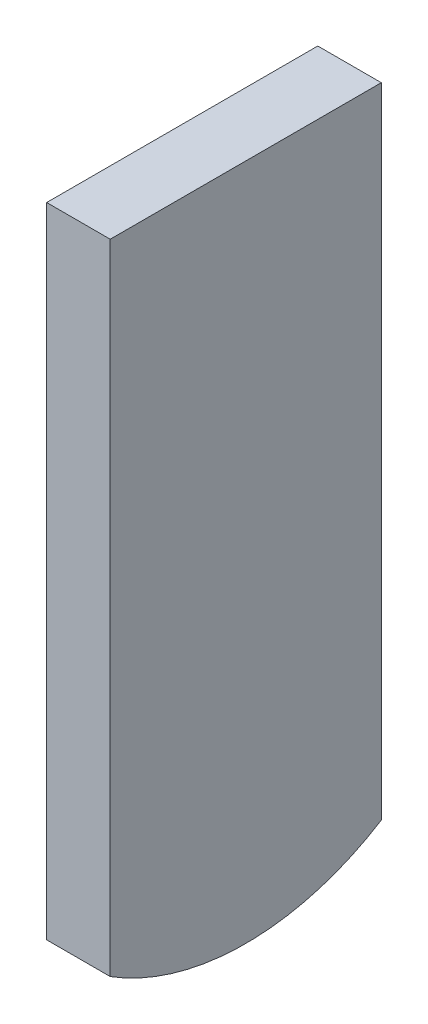
ISO-10303-21;
HEADER;
FILE_DESCRIPTION(('STEP AP214'),'2;1');
FILE_NAME('part.step','',(''),(''),'','','');
FILE_SCHEMA(('AUTOMOTIVE_DESIGN { 1 0 10303 214 1 1 1 1 }'));
ENDSEC;
DATA;
#1=APPLICATION_CONTEXT('core data for automotive mechanical design processes');
#2=APPLICATION_PROTOCOL_DEFINITION('international standard','automotive_design',2000,#1);
#3=PRODUCT_CONTEXT('',#1,'mechanical');
#4=PRODUCT('Part','Part','',(#3));
#5=PRODUCT_RELATED_PRODUCT_CATEGORY('part','',(#4));
#6=PRODUCT_DEFINITION_FORMATION('','',#4);
#7=PRODUCT_DEFINITION_CONTEXT('part definition',#1,'design');
#8=PRODUCT_DEFINITION('design','',#6,#7);
#9=PRODUCT_DEFINITION_SHAPE('','',#8);
#10=(LENGTH_UNIT() NAMED_UNIT(*) SI_UNIT(.MILLI.,.METRE.));
#11=(NAMED_UNIT(*) PLANE_ANGLE_UNIT() SI_UNIT($,.RADIAN.));
#12=(NAMED_UNIT(*) SI_UNIT($,.STERADIAN.) SOLID_ANGLE_UNIT());
#13=UNCERTAINTY_MEASURE_WITH_UNIT(LENGTH_MEASURE(1.E-05),#10,'distance_accuracy_value','');
#14=(GEOMETRIC_REPRESENTATION_CONTEXT(3) GLOBAL_UNCERTAINTY_ASSIGNED_CONTEXT((#13)) GLOBAL_UNIT_ASSIGNED_CONTEXT((#10,
#11,#12)) REPRESENTATION_CONTEXT('',''));
#15=CARTESIAN_POINT('',(0.,0.,0.));
#16=DIRECTION('',(0.,0.,1.));
#17=DIRECTION('',(1.,0.,0.));
#18=AXIS2_PLACEMENT_3D('',#15,#16,#17);
#19=CARTESIAN_POINT('',(22.5596096334287,-9.99999999999998,0.));
#20=DIRECTION('',(-0.999999999999997,0.,0.));
#21=DIRECTION('',(0.,0.,0.999999999999997));
#22=AXIS2_PLACEMENT_3D('',#19,#20,#21);
#23=CYLINDRICAL_SURFACE('',#22,6.);
#24=DIRECTION('',(-0.999999999999997,0.,0.));
#25=VECTOR('',#24,1.);
#26=CARTESIAN_POINT('',(22.5596096334285,-15.0754310161798,-3.19999999999993));
#27=LINE('',#26,#25);
#28=CARTESIAN_POINT('',(0.750000000000141,-15.0754310161798,-3.19999999999997));
#29=VERTEX_POINT('',#28);
#30=CARTESIAN_POINT('',(-0.749999999999917,-15.0754310161798,-3.19999999999987));
#31=VERTEX_POINT('',#30);
#32=EDGE_CURVE('E79',#29,#31,#27,.T.);
#33=ORIENTED_EDGE('',*,*,#32,.F.);
#34=CARTESIAN_POINT('',(0.750000000000001,-10.,0.));
#35=DIRECTION('',(0.999999999999997,0.,0.));
#36=DIRECTION('',(0.,0.,-0.999999999999997));
#37=AXIS2_PLACEMENT_3D('',#34,#35,#36);
#38=CIRCLE('',#37,6.);
#39=CARTESIAN_POINT('',(0.750000000000197,-15.0754310161798,3.20000000000014));
#40=VERTEX_POINT('',#39);
#41=EDGE_CURVE('E51',#29,#40,#38,.F.);
#42=ORIENTED_EDGE('',*,*,#41,.T.);
#43=DIRECTION('',(-0.999999999999997,0.,0.));
#44=VECTOR('',#43,1.);
#45=CARTESIAN_POINT('',(22.5596096334285,-15.0754310161798,3.19999999999998));
#46=LINE('',#45,#44);
#47=CARTESIAN_POINT('',(-0.750000000000028,-15.0754310161798,3.19999999999998));
#48=VERTEX_POINT('',#47);
#49=EDGE_CURVE('E90',#40,#48,#46,.T.);
#50=ORIENTED_EDGE('',*,*,#49,.T.);
#51=CARTESIAN_POINT('',(-0.74999999999964,-10.,0.));
#52=DIRECTION('',(-0.999999999999997,0.,0.));
#53=DIRECTION('',(0.,0.,0.999999999999997));
#54=AXIS2_PLACEMENT_3D('',#51,#52,#53);
#55=CIRCLE('',#54,6.);
#56=EDGE_CURVE('E59',#48,#31,#55,.F.);
#57=ORIENTED_EDGE('',*,*,#56,.T.);
#58=EDGE_LOOP('',(#33,#42,#50,#57));
#59=FACE_BOUND('',#58,.T.);
#60=ADVANCED_FACE('F34',(#59),#23,.T.);
#61=CARTESIAN_POINT('',(0.750000000000197,-15.9999999999999,3.20000000000014));
#62=DIRECTION('',(0.999999999999997,0.,0.));
#63=DIRECTION('',(0.,0.,-0.999999999999997));
#64=AXIS2_PLACEMENT_3D('',#61,#62,#63);
#65=PLANE('',#64);
#66=ORIENTED_EDGE('',*,*,#41,.F.);
#67=DIRECTION('',(0.,1.,0.));
#68=VECTOR('',#67,1.);
#69=CARTESIAN_POINT('',(0.750000000000141,-15.9999999999999,-3.19999999999997));
#70=LINE('',#69,#68);
#71=CARTESIAN_POINT('',(0.750000000000141,0.,-3.19999999999997));
#72=VERTEX_POINT('',#71);
#73=EDGE_CURVE('E38',#29,#72,#70,.T.);
#74=ORIENTED_EDGE('',*,*,#73,.T.);
#75=DIRECTION('',(0.,0.,-0.999999999999997));
#76=VECTOR('',#75,1.);
#77=CARTESIAN_POINT('',(0.750000000000197,0.,3.20000000000014));
#78=LINE('',#77,#76);
#79=CARTESIAN_POINT('',(0.750000000000197,0.,3.20000000000014));
#80=VERTEX_POINT('',#79);
#81=EDGE_CURVE('E88',#80,#72,#78,.T.);
#82=ORIENTED_EDGE('',*,*,#81,.F.);
#83=DIRECTION('',(0.,1.,0.));
#84=VECTOR('',#83,1.);
#85=CARTESIAN_POINT('',(0.750000000000197,-15.9999999999999,3.20000000000014));
#86=LINE('',#85,#84);
#87=EDGE_CURVE('E11',#40,#80,#86,.T.);
#88=ORIENTED_EDGE('',*,*,#87,.F.);
#89=EDGE_LOOP('',(#66,#74,#82,#88));
#90=FACE_BOUND('',#89,.T.);
#91=ADVANCED_FACE('F36',(#90),#65,.T.);
#92=CARTESIAN_POINT('',(-0.750000000000028,-15.9999999999999,3.19999999999998));
#93=DIRECTION('',(0.,0.,0.999999999999997));
#94=DIRECTION('',(0.999999999999997,0.,0.));
#95=AXIS2_PLACEMENT_3D('',#92,#93,#94);
#96=PLANE('',#95);
#97=ORIENTED_EDGE('',*,*,#49,.F.);
#98=ORIENTED_EDGE('',*,*,#87,.T.);
#99=DIRECTION('',(0.999999999999997,0.,0.));
#100=VECTOR('',#99,1.);
#101=CARTESIAN_POINT('',(-0.750000000000028,0.,3.19999999999998));
#102=LINE('',#101,#100);
#103=CARTESIAN_POINT('',(-0.750000000000028,0.,3.19999999999998));
#104=VERTEX_POINT('',#103);
#105=EDGE_CURVE('E86',#104,#80,#102,.T.);
#106=ORIENTED_EDGE('',*,*,#105,.F.);
#107=DIRECTION('',(0.,1.,0.));
#108=VECTOR('',#107,1.);
#109=CARTESIAN_POINT('',(-0.750000000000028,-15.9999999999999,3.19999999999998));
#110=LINE('',#109,#108);
#111=EDGE_CURVE('E43',#48,#104,#110,.T.);
#112=ORIENTED_EDGE('',*,*,#111,.F.);
#113=EDGE_LOOP('',(#97,#98,#106,#112));
#114=FACE_BOUND('',#113,.T.);
#115=ADVANCED_FACE('F108',(#114),#96,.T.);
#116=CARTESIAN_POINT('',(-0.750000000000028,-15.9999999999999,3.19999999999998));
#117=DIRECTION('',(-0.999999999999997,0.,0.));
#118=DIRECTION('',(0.,0.,0.999999999999997));
#119=AXIS2_PLACEMENT_3D('',#116,#117,#118);
#120=PLANE('',#119);
#121=ORIENTED_EDGE('',*,*,#56,.F.);
#122=ORIENTED_EDGE('',*,*,#111,.T.);
#123=DIRECTION('',(0.,0.,0.999999999999997));
#124=VECTOR('',#123,1.);
#125=CARTESIAN_POINT('',(-0.750000000000028,0.,3.19999999999998));
#126=LINE('',#125,#124);
#127=CARTESIAN_POINT('',(-0.749999999999917,0.,-3.19999999999987));
#128=VERTEX_POINT('',#127);
#129=EDGE_CURVE('E97',#128,#104,#126,.T.);
#130=ORIENTED_EDGE('',*,*,#129,.F.);
#131=DIRECTION('',(0.,1.,0.));
#132=VECTOR('',#131,1.);
#133=CARTESIAN_POINT('',(-0.749999999999917,-15.9999999999999,-3.19999999999987));
#134=LINE('',#133,#132);
#135=EDGE_CURVE('E85',#31,#128,#134,.T.);
#136=ORIENTED_EDGE('',*,*,#135,.F.);
#137=EDGE_LOOP('',(#121,#122,#130,#136));
#138=FACE_BOUND('',#137,.T.);
#139=ADVANCED_FACE('F103',(#138),#120,.T.);
#140=CARTESIAN_POINT('',(-0.749999999999917,-15.9999999999999,-3.19999999999987));
#141=DIRECTION('',(0.,0.,-0.999999999999997));
#142=DIRECTION('',(-0.999999999999997,0.,0.));
#143=AXIS2_PLACEMENT_3D('',#140,#141,#142);
#144=PLANE('',#143);
#145=ORIENTED_EDGE('',*,*,#32,.T.);
#146=ORIENTED_EDGE('',*,*,#135,.T.);
#147=DIRECTION('',(-0.999999999999997,0.,0.));
#148=VECTOR('',#147,1.);
#149=CARTESIAN_POINT('',(-0.749999999999917,0.,-3.19999999999987));
#150=LINE('',#149,#148);
#151=EDGE_CURVE('E81',#72,#128,#150,.T.);
#152=ORIENTED_EDGE('',*,*,#151,.F.);
#153=ORIENTED_EDGE('',*,*,#73,.F.);
#154=EDGE_LOOP('',(#145,#146,#152,#153));
#155=FACE_BOUND('',#154,.T.);
#156=ADVANCED_FACE('F78',(#155),#144,.T.);
#157=CARTESIAN_POINT('',(0.,0.,0.));
#158=DIRECTION('',(0.,-1.,0.));
#159=DIRECTION('',(0.,0.,-0.999999999999997));
#160=AXIS2_PLACEMENT_3D('',#157,#158,#159);
#161=PLANE('',#160);
#162=ORIENTED_EDGE('',*,*,#81,.T.);
#163=ORIENTED_EDGE('',*,*,#151,.T.);
#164=ORIENTED_EDGE('',*,*,#129,.T.);
#165=ORIENTED_EDGE('',*,*,#105,.T.);
#166=EDGE_LOOP('',(#162,#163,#164,#165));
#167=FACE_BOUND('',#166,.T.);
#168=ADVANCED_FACE('F106',(#167),#161,.F.);
#169=CLOSED_SHELL('',(#60,#91,#115,#139,#156,#168));
#170=MANIFOLD_SOLID_BREP('B2',#169);
#171=ADVANCED_BREP_SHAPE_REPRESENTATION('',(#18,#170),#14);
#172=SHAPE_DEFINITION_REPRESENTATION(#9,#171);
ENDSEC;
END-ISO-10303-21;
